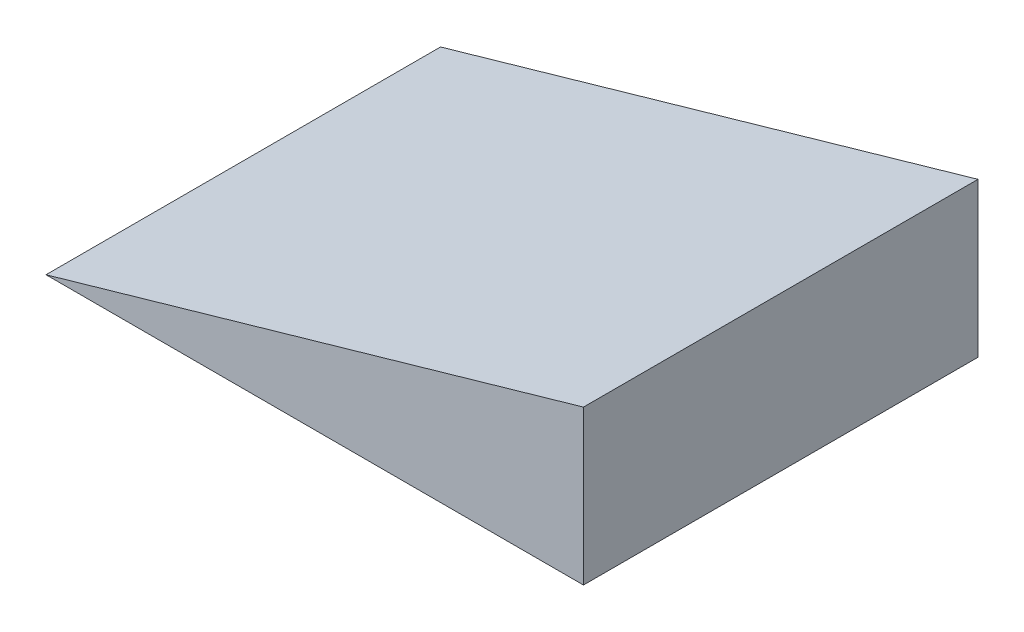
ISO-10303-21;
HEADER;
FILE_DESCRIPTION(('STEP AP214'),'2;1');
FILE_NAME('part.step','',(''),(''),'','','');
FILE_SCHEMA(('AUTOMOTIVE_DESIGN { 1 0 10303 214 1 1 1 1 }'));
ENDSEC;
DATA;
#1=APPLICATION_CONTEXT('core data for automotive mechanical design processes');
#2=APPLICATION_PROTOCOL_DEFINITION('international standard','automotive_design',2000,#1);
#3=PRODUCT_CONTEXT('',#1,'mechanical');
#4=PRODUCT('Part','Part','',(#3));
#5=PRODUCT_RELATED_PRODUCT_CATEGORY('part','',(#4));
#6=PRODUCT_DEFINITION_FORMATION('','',#4);
#7=PRODUCT_DEFINITION_CONTEXT('part definition',#1,'design');
#8=PRODUCT_DEFINITION('design','',#6,#7);
#9=PRODUCT_DEFINITION_SHAPE('','',#8);
#10=(LENGTH_UNIT() NAMED_UNIT(*) SI_UNIT(.MILLI.,.METRE.));
#11=(NAMED_UNIT(*) PLANE_ANGLE_UNIT() SI_UNIT($,.RADIAN.));
#12=(NAMED_UNIT(*) SI_UNIT($,.STERADIAN.) SOLID_ANGLE_UNIT());
#13=UNCERTAINTY_MEASURE_WITH_UNIT(LENGTH_MEASURE(1.E-05),#10,'distance_accuracy_value','');
#14=(GEOMETRIC_REPRESENTATION_CONTEXT(3) GLOBAL_UNCERTAINTY_ASSIGNED_CONTEXT((#13)) GLOBAL_UNIT_ASSIGNED_CONTEXT((#10,
#11,#12)) REPRESENTATION_CONTEXT('',''));
#15=CARTESIAN_POINT('',(0.,0.,0.));
#16=DIRECTION('',(0.,0.,1.));
#17=DIRECTION('',(1.,0.,0.));
#18=AXIS2_PLACEMENT_3D('',#15,#16,#17);
#19=CARTESIAN_POINT('',(-553.627042959758,0.,-406.4));
#20=DIRECTION('',(0.,-1.,0.));
#21=DIRECTION('',(1.,0.,0.));
#22=AXIS2_PLACEMENT_3D('',#19,#20,#21);
#23=PLANE('',#22);
#24=DIRECTION('',(1.,0.,0.));
#25=VECTOR('',#24,1.);
#26=CARTESIAN_POINT('',(-553.627042959758,0.,0.));
#27=LINE('',#26,#25);
#28=CARTESIAN_POINT('',(-553.627042959758,0.,0.));
#29=VERTEX_POINT('',#28);
#30=CARTESIAN_POINT('',(0.,0.,0.));
#31=VERTEX_POINT('',#30);
#32=EDGE_CURVE('E85',#29,#31,#27,.T.);
#33=ORIENTED_EDGE('',*,*,#32,.F.);
#34=DIRECTION('',(0.,0.,1.));
#35=VECTOR('',#34,1.);
#36=CARTESIAN_POINT('',(-553.627042959758,0.,-406.4));
#37=LINE('',#36,#35);
#38=CARTESIAN_POINT('',(-553.627042959758,0.,-406.4));
#39=VERTEX_POINT('',#38);
#40=EDGE_CURVE('E11',#39,#29,#37,.T.);
#41=ORIENTED_EDGE('',*,*,#40,.F.);
#42=DIRECTION('',(1.,0.,0.));
#43=VECTOR('',#42,1.);
#44=CARTESIAN_POINT('',(-553.627042959758,0.,-406.4));
#45=LINE('',#44,#43);
#46=CARTESIAN_POINT('',(0.,0.,-406.4));
#47=VERTEX_POINT('',#46);
#48=EDGE_CURVE('E77',#39,#47,#45,.T.);
#49=ORIENTED_EDGE('',*,*,#48,.T.);
#50=DIRECTION('',(0.,0.,1.));
#51=VECTOR('',#50,1.);
#52=CARTESIAN_POINT('',(0.,0.,-406.4));
#53=LINE('',#52,#51);
#54=EDGE_CURVE('E36',#47,#31,#53,.T.);
#55=ORIENTED_EDGE('',*,*,#54,.T.);
#56=EDGE_LOOP('',(#33,#41,#49,#55));
#57=FACE_BOUND('',#56,.T.);
#58=ADVANCED_FACE('F33',(#57),#23,.T.);
#59=CARTESIAN_POINT('',(0.,158.75,-406.4));
#60=DIRECTION('',(-0.275637355816993,0.961261695938321,0.));
#61=DIRECTION('',(-0.961261695938321,-0.275637355816993,0.));
#62=AXIS2_PLACEMENT_3D('',#59,#60,#61);
#63=PLANE('',#62);
#64=DIRECTION('',(-0.961261695938321,-0.275637355816993,0.));
#65=VECTOR('',#64,1.);
#66=CARTESIAN_POINT('',(0.,158.75,0.));
#67=LINE('',#66,#65);
#68=CARTESIAN_POINT('',(0.,158.75,0.));
#69=VERTEX_POINT('',#68);
#70=EDGE_CURVE('E79',#69,#29,#67,.T.);
#71=ORIENTED_EDGE('',*,*,#70,.F.);
#72=DIRECTION('',(0.,0.,1.));
#73=VECTOR('',#72,1.);
#74=CARTESIAN_POINT('',(0.,158.75,-406.4));
#75=LINE('',#74,#73);
#76=CARTESIAN_POINT('',(0.,158.75,-406.4));
#77=VERTEX_POINT('',#76);
#78=EDGE_CURVE('E42',#77,#69,#75,.T.);
#79=ORIENTED_EDGE('',*,*,#78,.F.);
#80=DIRECTION('',(-0.961261695938321,-0.275637355816993,0.));
#81=VECTOR('',#80,1.);
#82=CARTESIAN_POINT('',(0.,158.75,-406.4));
#83=LINE('',#82,#81);
#84=EDGE_CURVE('E74',#77,#39,#83,.T.);
#85=ORIENTED_EDGE('',*,*,#84,.T.);
#86=ORIENTED_EDGE('',*,*,#40,.T.);
#87=EDGE_LOOP('',(#71,#79,#85,#86));
#88=FACE_BOUND('',#87,.T.);
#89=ADVANCED_FACE('F89',(#88),#63,.T.);
#90=CARTESIAN_POINT('',(0.,0.,-406.4));
#91=DIRECTION('',(1.,0.,0.));
#92=DIRECTION('',(0.,0.,-1.));
#93=AXIS2_PLACEMENT_3D('',#90,#91,#92);
#94=PLANE('',#93);
#95=DIRECTION('',(0.,1.,0.));
#96=VECTOR('',#95,1.);
#97=CARTESIAN_POINT('',(0.,0.,0.));
#98=LINE('',#97,#96);
#99=EDGE_CURVE('E72',#31,#69,#98,.T.);
#100=ORIENTED_EDGE('',*,*,#99,.F.);
#101=ORIENTED_EDGE('',*,*,#54,.F.);
#102=DIRECTION('',(0.,1.,0.));
#103=VECTOR('',#102,1.);
#104=CARTESIAN_POINT('',(0.,0.,-406.4));
#105=LINE('',#104,#103);
#106=EDGE_CURVE('E70',#47,#77,#105,.T.);
#107=ORIENTED_EDGE('',*,*,#106,.T.);
#108=ORIENTED_EDGE('',*,*,#78,.T.);
#109=EDGE_LOOP('',(#100,#101,#107,#108));
#110=FACE_BOUND('',#109,.T.);
#111=ADVANCED_FACE('F69',(#110),#94,.T.);
#112=CARTESIAN_POINT('',(0.,0.,-406.4));
#113=DIRECTION('',(0.,0.,1.));
#114=DIRECTION('',(1.,0.,0.));
#115=AXIS2_PLACEMENT_3D('',#112,#113,#114);
#116=PLANE('',#115);
#117=ORIENTED_EDGE('',*,*,#48,.F.);
#118=ORIENTED_EDGE('',*,*,#84,.F.);
#119=ORIENTED_EDGE('',*,*,#106,.F.);
#120=EDGE_LOOP('',(#117,#118,#119));
#121=FACE_BOUND('',#120,.T.);
#122=ADVANCED_FACE('F76',(#121),#116,.F.);
#123=CARTESIAN_POINT('',(0.,0.,0.));
#124=DIRECTION('',(0.,0.,1.));
#125=DIRECTION('',(1.,0.,0.));
#126=AXIS2_PLACEMENT_3D('',#123,#124,#125);
#127=PLANE('',#126);
#128=ORIENTED_EDGE('',*,*,#32,.T.);
#129=ORIENTED_EDGE('',*,*,#99,.T.);
#130=ORIENTED_EDGE('',*,*,#70,.T.);
#131=EDGE_LOOP('',(#128,#129,#130));
#132=FACE_BOUND('',#131,.T.);
#133=ADVANCED_FACE('F88',(#132),#127,.T.);
#134=CLOSED_SHELL('',(#58,#89,#111,#122,#133));
#135=MANIFOLD_SOLID_BREP('B2',#134);
#136=ADVANCED_BREP_SHAPE_REPRESENTATION('',(#18,#135),#14);
#137=SHAPE_DEFINITION_REPRESENTATION(#9,#136);
ENDSEC;
END-ISO-10303-21;
